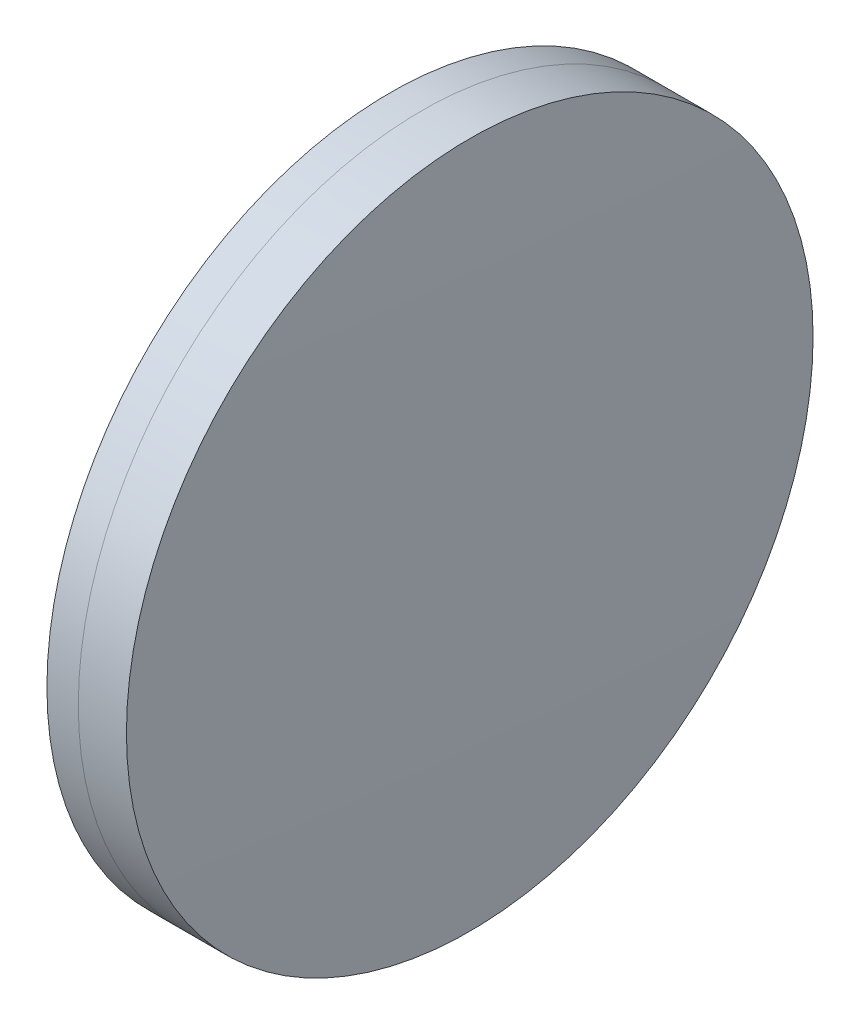
ISO-10303-21;
HEADER;
FILE_DESCRIPTION(('STEP AP214'),'2;1');
FILE_NAME('part.step','',(''),(''),'','','');
FILE_SCHEMA(('AUTOMOTIVE_DESIGN { 1 0 10303 214 1 1 1 1 }'));
ENDSEC;
DATA;
#1=APPLICATION_CONTEXT('core data for automotive mechanical design processes');
#2=APPLICATION_PROTOCOL_DEFINITION('international standard','automotive_design',2000,#1);
#3=PRODUCT_CONTEXT('',#1,'mechanical');
#4=PRODUCT('Part','Part','',(#3));
#5=PRODUCT_RELATED_PRODUCT_CATEGORY('part','',(#4));
#6=PRODUCT_DEFINITION_FORMATION('','',#4);
#7=PRODUCT_DEFINITION_CONTEXT('part definition',#1,'design');
#8=PRODUCT_DEFINITION('design','',#6,#7);
#9=PRODUCT_DEFINITION_SHAPE('','',#8);
#10=(LENGTH_UNIT() NAMED_UNIT(*) SI_UNIT(.MILLI.,.METRE.));
#11=(NAMED_UNIT(*) PLANE_ANGLE_UNIT() SI_UNIT($,.RADIAN.));
#12=(NAMED_UNIT(*) SI_UNIT($,.STERADIAN.) SOLID_ANGLE_UNIT());
#13=UNCERTAINTY_MEASURE_WITH_UNIT(LENGTH_MEASURE(1.E-05),#10,'distance_accuracy_value','');
#14=(GEOMETRIC_REPRESENTATION_CONTEXT(3) GLOBAL_UNCERTAINTY_ASSIGNED_CONTEXT((#13)) GLOBAL_UNIT_ASSIGNED_CONTEXT((#10,
#11,#12)) REPRESENTATION_CONTEXT('',''));
#15=CARTESIAN_POINT('',(0.,0.,0.));
#16=DIRECTION('',(0.,0.,1.));
#17=DIRECTION('',(1.,0.,0.));
#18=AXIS2_PLACEMENT_3D('',#15,#16,#17);
#19=CARTESIAN_POINT('',(457.780559274323,0.,0.));
#20=DIRECTION('',(-1.,0.,0.));
#21=DIRECTION('',(0.,0.,1.));
#22=AXIS2_PLACEMENT_3D('',#19,#20,#21);
#23=SPHERICAL_SURFACE('',#22,259.4);
#24=CARTESIAN_POINT('',(715.9340020172,0.,0.));
#25=DIRECTION('',(-1.,0.,0.));
#26=DIRECTION('',(0.,0.,1.));
#27=AXIS2_PLACEMENT_3D('',#24,#25,#26);
#28=CIRCLE('',#27,25.4000000000001);
#29=CARTESIAN_POINT('',(715.9340020172,0.,25.4000000000001));
#30=VERTEX_POINT('',#29);
#31=EDGE_CURVE('E11',#30,#30,#28,.T.);
#32=ORIENTED_EDGE('',*,*,#31,.T.);
#33=EDGE_LOOP('',(#32));
#34=FACE_BOUND('',#33,.T.);
#35=ADVANCED_FACE('F45',(#34),#23,.F.);
#36=CARTESIAN_POINT('',(-0.551919992657797,0.,0.));
#37=DIRECTION('',(-1.,0.,0.));
#38=DIRECTION('',(0.,0.,1.));
#39=AXIS2_PLACEMENT_3D('',#36,#37,#38);
#40=CYLINDRICAL_SURFACE('',#39,25.3999999999999);
#41=CARTESIAN_POINT('',(719.49565942978,0.,0.));
#42=DIRECTION('',(-1.,0.,0.));
#43=DIRECTION('',(0.,0.,1.));
#44=AXIS2_PLACEMENT_3D('',#41,#42,#43);
#45=CIRCLE('',#44,25.3999999999998);
#46=CARTESIAN_POINT('',(719.49565942978,0.,25.3999999999998));
#47=VERTEX_POINT('',#46);
#48=EDGE_CURVE('E51',#47,#47,#45,.T.);
#49=ORIENTED_EDGE('',*,*,#48,.T.);
#50=EDGE_LOOP('',(#49));
#51=FACE_BOUND('',#50,.T.);
#52=ORIENTED_EDGE('',*,*,#31,.F.);
#53=EDGE_LOOP('',(#52));
#54=FACE_BOUND('',#53,.T.);
#55=ADVANCED_FACE('F57',(#51,#54),#40,.T.);
#56=CARTESIAN_POINT('',(-412.619440725677,0.,0.));
#57=DIRECTION('',(-1.,0.,0.));
#58=DIRECTION('',(0.,0.,1.));
#59=AXIS2_PLACEMENT_3D('',#56,#57,#58);
#60=SPHERICAL_SURFACE('',#59,1132.4);
#61=ORIENTED_EDGE('',*,*,#48,.F.);
#62=EDGE_LOOP('',(#61));
#63=FACE_BOUND('',#62,.T.);
#64=ADVANCED_FACE('F60',(#63),#60,.T.);
#65=CLOSED_SHELL('',(#35,#55,#64));
#66=MANIFOLD_SOLID_BREP('B2',#65);
#67=CARTESIAN_POINT('',(1059.38055927432,0.,0.));
#68=DIRECTION('',(-1.,0.,0.));
#69=DIRECTION('',(0.,0.,1.));
#70=AXIS2_PLACEMENT_3D('',#67,#68,#69);
#71=SPHERICAL_SURFACE('',#70,346.7);
#72=CARTESIAN_POINT('',(713.612240887574,0.,0.));
#73=DIRECTION('',(-1.,0.,0.));
#74=DIRECTION('',(0.,0.,1.));
#75=AXIS2_PLACEMENT_3D('',#72,#73,#74);
#76=CIRCLE('',#75,25.4);
#77=CARTESIAN_POINT('',(713.612240887574,0.,25.4));
#78=VERTEX_POINT('',#77);
#79=EDGE_CURVE('E44',#78,#78,#76,.T.);
#80=ORIENTED_EDGE('',*,*,#79,.T.);
#81=EDGE_LOOP('',(#80));
#82=FACE_BOUND('',#81,.T.);
#83=ADVANCED_FACE('F86',(#82),#71,.T.);
#84=CARTESIAN_POINT('',(124.523309526045,0.,0.));
#85=DIRECTION('',(-1.,0.,0.));
#86=DIRECTION('',(0.,0.,1.));
#87=AXIS2_PLACEMENT_3D('',#84,#85,#86);
#88=CYLINDRICAL_SURFACE('',#87,25.4);
#89=CARTESIAN_POINT('',(715.9340020172,0.,0.));
#90=DIRECTION('',(-1.,0.,0.));
#91=DIRECTION('',(0.,0.,1.));
#92=AXIS2_PLACEMENT_3D('',#89,#90,#91);
#93=CIRCLE('',#92,25.4);
#94=CARTESIAN_POINT('',(715.9340020172,0.,25.4));
#95=VERTEX_POINT('',#94);
#96=EDGE_CURVE('E92',#95,#95,#93,.T.);
#97=ORIENTED_EDGE('',*,*,#96,.T.);
#98=EDGE_LOOP('',(#97));
#99=FACE_BOUND('',#98,.T.);
#100=ORIENTED_EDGE('',*,*,#79,.F.);
#101=EDGE_LOOP('',(#100));
#102=FACE_BOUND('',#101,.T.);
#103=ADVANCED_FACE('F98',(#99,#102),#88,.T.);
#104=CARTESIAN_POINT('',(457.780559274323,0.,0.));
#105=DIRECTION('',(-1.,0.,0.));
#106=DIRECTION('',(0.,0.,1.));
#107=AXIS2_PLACEMENT_3D('',#104,#105,#106);
#108=SPHERICAL_SURFACE('',#107,259.4);
#109=ORIENTED_EDGE('',*,*,#96,.F.);
#110=EDGE_LOOP('',(#109));
#111=FACE_BOUND('',#110,.T.);
#112=ADVANCED_FACE('F101',(#111),#108,.T.);
#113=CLOSED_SHELL('',(#83,#103,#112));
#114=MANIFOLD_SOLID_BREP('B6',#113);
#115=ADVANCED_BREP_SHAPE_REPRESENTATION('',(#18,#66,#114),#14);
#116=SHAPE_DEFINITION_REPRESENTATION(#9,#115);
ENDSEC;
END-ISO-10303-21;
